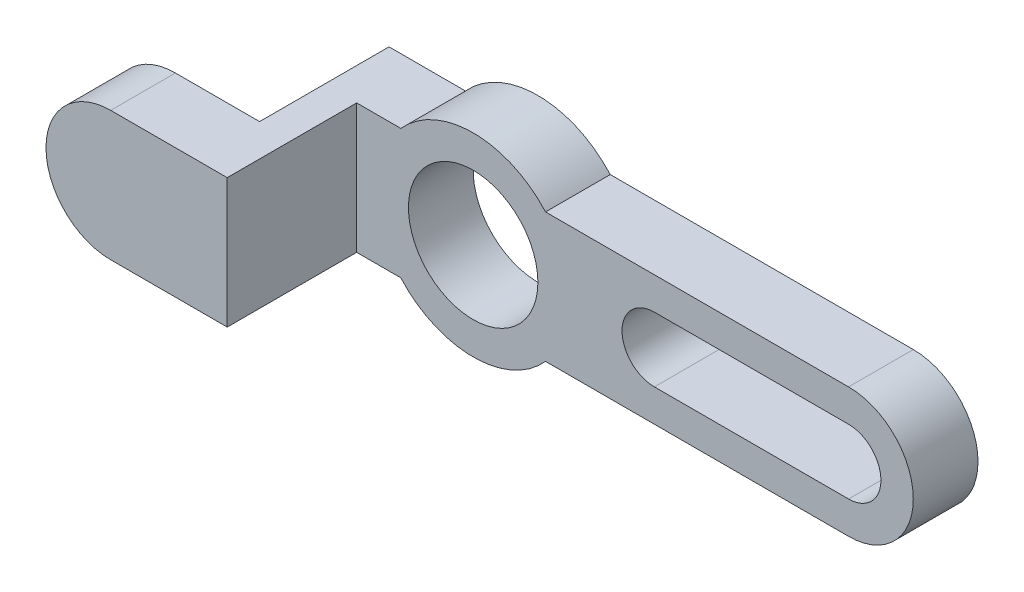
ISO-10303-21;
HEADER;
FILE_DESCRIPTION(('STEP AP214'),'2;1');
FILE_NAME('part.step','',(''),(''),'','','');
FILE_SCHEMA(('AUTOMOTIVE_DESIGN { 1 0 10303 214 1 1 1 1 }'));
ENDSEC;
DATA;
#1=APPLICATION_CONTEXT('core data for automotive mechanical design processes');
#2=APPLICATION_PROTOCOL_DEFINITION('international standard','automotive_design',2000,#1);
#3=PRODUCT_CONTEXT('',#1,'mechanical');
#4=PRODUCT('Part','Part','',(#3));
#5=PRODUCT_RELATED_PRODUCT_CATEGORY('part','',(#4));
#6=PRODUCT_DEFINITION_FORMATION('','',#4);
#7=PRODUCT_DEFINITION_CONTEXT('part definition',#1,'design');
#8=PRODUCT_DEFINITION('design','',#6,#7);
#9=PRODUCT_DEFINITION_SHAPE('','',#8);
#10=(LENGTH_UNIT() NAMED_UNIT(*) SI_UNIT(.MILLI.,.METRE.));
#11=(NAMED_UNIT(*) PLANE_ANGLE_UNIT() SI_UNIT($,.RADIAN.));
#12=(NAMED_UNIT(*) SI_UNIT($,.STERADIAN.) SOLID_ANGLE_UNIT());
#13=UNCERTAINTY_MEASURE_WITH_UNIT(LENGTH_MEASURE(1.E-05),#10,'distance_accuracy_value','');
#14=(GEOMETRIC_REPRESENTATION_CONTEXT(3) GLOBAL_UNCERTAINTY_ASSIGNED_CONTEXT((#13)) GLOBAL_UNIT_ASSIGNED_CONTEXT((#10,
#11,#12)) REPRESENTATION_CONTEXT('',''));
#15=CARTESIAN_POINT('',(0.,0.,0.));
#16=DIRECTION('',(0.,0.,1.));
#17=DIRECTION('',(1.,0.,0.));
#18=AXIS2_PLACEMENT_3D('',#15,#16,#17);
#19=CARTESIAN_POINT('',(0.,0.,-3.175));
#20=DIRECTION('',(0.,0.,1.));
#21=DIRECTION('',(1.,0.,0.));
#22=AXIS2_PLACEMENT_3D('',#19,#20,#21);
#23=PLANE('',#22);
#24=CARTESIAN_POINT('',(17.78,0.,-3.175));
#25=DIRECTION('',(0.,0.,1.));
#26=DIRECTION('',(1.,0.,0.));
#27=AXIS2_PLACEMENT_3D('',#24,#25,#26);
#28=CIRCLE('',#27,3.17500000000001);
#29=CARTESIAN_POINT('',(17.78,-3.17500000000001,-3.175));
#30=VERTEX_POINT('',#29);
#31=CARTESIAN_POINT('',(17.78,3.17500000000001,-3.175));
#32=VERTEX_POINT('',#31);
#33=EDGE_CURVE('E247',#30,#32,#28,.F.);
#34=ORIENTED_EDGE('',*,*,#33,.F.);
#35=DIRECTION('',(-1.,0.,0.));
#36=VECTOR('',#35,1.);
#37=CARTESIAN_POINT('',(36.83,-3.17500000000001,-3.175));
#38=LINE('',#37,#36);
#39=CARTESIAN_POINT('',(36.83,-3.17500000000001,-3.175));
#40=VERTEX_POINT('',#39);
#41=EDGE_CURVE('E239',#40,#30,#38,.T.);
#42=ORIENTED_EDGE('',*,*,#41,.F.);
#43=CARTESIAN_POINT('',(36.83,0.,-3.175));
#44=DIRECTION('',(0.,0.,-1.));
#45=DIRECTION('',(-1.,0.,0.));
#46=AXIS2_PLACEMENT_3D('',#43,#44,#45);
#47=CIRCLE('',#46,3.17500000000001);
#48=CARTESIAN_POINT('',(36.83,3.17500000000001,-3.175));
#49=VERTEX_POINT('',#48);
#50=EDGE_CURVE('E235',#49,#40,#47,.T.);
#51=ORIENTED_EDGE('',*,*,#50,.F.);
#52=DIRECTION('',(1.,0.,0.));
#53=VECTOR('',#52,1.);
#54=CARTESIAN_POINT('',(36.83,3.17500000000001,-3.175));
#55=LINE('',#54,#53);
#56=EDGE_CURVE('E249',#32,#49,#55,.T.);
#57=ORIENTED_EDGE('',*,*,#56,.F.);
#58=EDGE_LOOP('',(#34,#42,#51,#57));
#59=FACE_BOUND('',#58,.T.);
#60=CARTESIAN_POINT('',(0.,0.,-3.175));
#61=DIRECTION('',(0.,0.,1.));
#62=DIRECTION('',(1.,0.,0.));
#63=AXIS2_PLACEMENT_3D('',#60,#61,#62);
#64=CIRCLE('',#63,6.35);
#65=CARTESIAN_POINT('',(6.35,0.,-3.175));
#66=VERTEX_POINT('',#65);
#67=EDGE_CURVE('E285',#66,#66,#64,.T.);
#68=ORIENTED_EDGE('',*,*,#67,.T.);
#69=EDGE_LOOP('',(#68));
#70=FACE_BOUND('',#69,.T.);
#71=DIRECTION('',(0.,1.,0.));
#72=VECTOR('',#71,1.);
#73=CARTESIAN_POINT('',(-14.605,6.35,-3.175));
#74=LINE('',#73,#72);
#75=CARTESIAN_POINT('',(-14.605,-6.35,-3.175));
#76=VERTEX_POINT('',#75);
#77=CARTESIAN_POINT('',(-14.605,6.35,-3.175));
#78=VERTEX_POINT('',#77);
#79=EDGE_CURVE('E160',#76,#78,#74,.T.);
#80=ORIENTED_EDGE('',*,*,#79,.T.);
#81=DIRECTION('',(-1.,0.,0.));
#82=VECTOR('',#81,1.);
#83=CARTESIAN_POINT('',(-17.78,6.35,-3.175));
#84=LINE('',#83,#82);
#85=CARTESIAN_POINT('',(-7.09951582856183,6.35,-3.175));
#86=VERTEX_POINT('',#85);
#87=EDGE_CURVE('E188',#86,#78,#84,.T.);
#88=ORIENTED_EDGE('',*,*,#87,.F.);
#89=CARTESIAN_POINT('',(0.,0.,-3.175));
#90=DIRECTION('',(0.,0.,1.));
#91=DIRECTION('',(1.,0.,0.));
#92=AXIS2_PLACEMENT_3D('',#89,#90,#91);
#93=CIRCLE('',#92,9.525);
#94=CARTESIAN_POINT('',(7.09951582856183,6.35,-3.175));
#95=VERTEX_POINT('',#94);
#96=EDGE_CURVE('E87',#95,#86,#93,.T.);
#97=ORIENTED_EDGE('',*,*,#96,.F.);
#98=DIRECTION('',(-1.,0.,0.));
#99=VECTOR('',#98,1.);
#100=CARTESIAN_POINT('',(7.09951582856183,6.35,-3.175));
#101=LINE('',#100,#99);
#102=CARTESIAN_POINT('',(36.83,6.35,-3.175));
#103=VERTEX_POINT('',#102);
#104=EDGE_CURVE('E201',#103,#95,#101,.T.);
#105=ORIENTED_EDGE('',*,*,#104,.F.);
#106=CARTESIAN_POINT('',(36.83,0.,-3.175));
#107=DIRECTION('',(0.,0.,-1.));
#108=DIRECTION('',(-1.,0.,0.));
#109=AXIS2_PLACEMENT_3D('',#106,#107,#108);
#110=CIRCLE('',#109,6.35);
#111=CARTESIAN_POINT('',(36.83,-6.35,-3.175));
#112=VERTEX_POINT('',#111);
#113=EDGE_CURVE('E275',#103,#112,#110,.T.);
#114=ORIENTED_EDGE('',*,*,#113,.T.);
#115=DIRECTION('',(1.,0.,0.));
#116=VECTOR('',#115,1.);
#117=CARTESIAN_POINT('',(36.83,-6.35,-3.175));
#118=LINE('',#117,#116);
#119=CARTESIAN_POINT('',(7.09951582856183,-6.35,-3.175));
#120=VERTEX_POINT('',#119);
#121=EDGE_CURVE('E192',#120,#112,#118,.T.);
#122=ORIENTED_EDGE('',*,*,#121,.F.);
#123=CARTESIAN_POINT('',(0.,0.,-3.175));
#124=DIRECTION('',(0.,0.,1.));
#125=DIRECTION('',(1.,0.,0.));
#126=AXIS2_PLACEMENT_3D('',#123,#124,#125);
#127=CIRCLE('',#126,9.525);
#128=CARTESIAN_POINT('',(-7.09951582856183,-6.35,-3.175));
#129=VERTEX_POINT('',#128);
#130=EDGE_CURVE('E186',#129,#120,#127,.T.);
#131=ORIENTED_EDGE('',*,*,#130,.F.);
#132=DIRECTION('',(1.,0.,0.));
#133=VECTOR('',#132,1.);
#134=CARTESIAN_POINT('',(-17.78,-6.35,-3.175));
#135=LINE('',#134,#133);
#136=EDGE_CURVE('E176',#76,#129,#135,.T.);
#137=ORIENTED_EDGE('',*,*,#136,.F.);
#138=EDGE_LOOP('',(#80,#88,#97,#105,#114,#122,#131,#137));
#139=FACE_BOUND('',#138,.T.);
#140=ADVANCED_FACE('F40',(#59,#70,#139),#23,.F.);
#141=CARTESIAN_POINT('',(0.,0.,3.175));
#142=DIRECTION('',(0.,0.,1.));
#143=DIRECTION('',(1.,0.,0.));
#144=AXIS2_PLACEMENT_3D('',#141,#142,#143);
#145=PLANE('',#144);
#146=DIRECTION('',(0.,1.,0.));
#147=VECTOR('',#146,1.);
#148=CARTESIAN_POINT('',(-11.43,6.35,3.175));
#149=LINE('',#148,#147);
#150=CARTESIAN_POINT('',(-11.43,-6.35,3.175));
#151=VERTEX_POINT('',#150);
#152=CARTESIAN_POINT('',(-11.43,6.35,3.175));
#153=VERTEX_POINT('',#152);
#154=EDGE_CURVE('E56',#151,#153,#149,.T.);
#155=ORIENTED_EDGE('',*,*,#154,.F.);
#156=DIRECTION('',(1.,0.,0.));
#157=VECTOR('',#156,1.);
#158=CARTESIAN_POINT('',(-17.78,-6.35,3.175));
#159=LINE('',#158,#157);
#160=CARTESIAN_POINT('',(-7.09951582856183,-6.35,3.175));
#161=VERTEX_POINT('',#160);
#162=EDGE_CURVE('E91',#151,#161,#159,.T.);
#163=ORIENTED_EDGE('',*,*,#162,.T.);
#164=CARTESIAN_POINT('',(0.,0.,3.175));
#165=DIRECTION('',(0.,0.,1.));
#166=DIRECTION('',(1.,0.,0.));
#167=AXIS2_PLACEMENT_3D('',#164,#165,#166);
#168=CIRCLE('',#167,9.525);
#169=CARTESIAN_POINT('',(7.09951582856183,-6.35,3.175));
#170=VERTEX_POINT('',#169);
#171=EDGE_CURVE('E296',#161,#170,#168,.T.);
#172=ORIENTED_EDGE('',*,*,#171,.T.);
#173=DIRECTION('',(1.,0.,0.));
#174=VECTOR('',#173,1.);
#175=CARTESIAN_POINT('',(7.09951582856183,-6.35,3.175));
#176=LINE('',#175,#174);
#177=CARTESIAN_POINT('',(36.83,-6.35,3.175));
#178=VERTEX_POINT('',#177);
#179=EDGE_CURVE('E299',#170,#178,#176,.T.);
#180=ORIENTED_EDGE('',*,*,#179,.T.);
#181=CARTESIAN_POINT('',(36.83,0.,3.175));
#182=DIRECTION('',(0.,0.,1.));
#183=DIRECTION('',(1.,0.,0.));
#184=AXIS2_PLACEMENT_3D('',#181,#182,#183);
#185=CIRCLE('',#184,6.35);
#186=CARTESIAN_POINT('',(36.83,6.35,3.175));
#187=VERTEX_POINT('',#186);
#188=EDGE_CURVE('E253',#187,#178,#185,.F.);
#189=ORIENTED_EDGE('',*,*,#188,.F.);
#190=DIRECTION('',(-1.,0.,0.));
#191=VECTOR('',#190,1.);
#192=CARTESIAN_POINT('',(31.75,6.35,3.175));
#193=LINE('',#192,#191);
#194=CARTESIAN_POINT('',(7.09951582856183,6.35,3.175));
#195=VERTEX_POINT('',#194);
#196=EDGE_CURVE('E303',#187,#195,#193,.T.);
#197=ORIENTED_EDGE('',*,*,#196,.T.);
#198=CARTESIAN_POINT('',(0.,0.,3.175));
#199=DIRECTION('',(0.,0.,1.));
#200=DIRECTION('',(1.,0.,0.));
#201=AXIS2_PLACEMENT_3D('',#198,#199,#200);
#202=CIRCLE('',#201,9.525);
#203=CARTESIAN_POINT('',(-7.09951582856183,6.35,3.175));
#204=VERTEX_POINT('',#203);
#205=EDGE_CURVE('E63',#195,#204,#202,.T.);
#206=ORIENTED_EDGE('',*,*,#205,.T.);
#207=DIRECTION('',(-1.,0.,0.));
#208=VECTOR('',#207,1.);
#209=CARTESIAN_POINT('',(-17.78,6.35,3.175));
#210=LINE('',#209,#208);
#211=EDGE_CURVE('E206',#204,#153,#210,.T.);
#212=ORIENTED_EDGE('',*,*,#211,.T.);
#213=EDGE_LOOP('',(#155,#163,#172,#180,#189,#197,#206,#212));
#214=FACE_BOUND('',#213,.T.);
#215=DIRECTION('',(1.,0.,0.));
#216=VECTOR('',#215,1.);
#217=CARTESIAN_POINT('',(36.83,-3.17500000000001,3.175));
#218=LINE('',#217,#216);
#219=CARTESIAN_POINT('',(17.78,-3.17500000000001,3.175));
#220=VERTEX_POINT('',#219);
#221=CARTESIAN_POINT('',(36.83,-3.17500000000001,3.175));
#222=VERTEX_POINT('',#221);
#223=EDGE_CURVE('E242',#220,#222,#218,.T.);
#224=ORIENTED_EDGE('',*,*,#223,.F.);
#225=CARTESIAN_POINT('',(17.78,0.,3.175));
#226=DIRECTION('',(0.,0.,1.));
#227=DIRECTION('',(1.,0.,0.));
#228=AXIS2_PLACEMENT_3D('',#225,#226,#227);
#229=CIRCLE('',#228,3.17500000000001);
#230=CARTESIAN_POINT('',(17.78,3.17500000000001,3.175));
#231=VERTEX_POINT('',#230);
#232=EDGE_CURVE('E263',#231,#220,#229,.T.);
#233=ORIENTED_EDGE('',*,*,#232,.F.);
#234=DIRECTION('',(-1.,0.,0.));
#235=VECTOR('',#234,1.);
#236=CARTESIAN_POINT('',(36.83,3.17500000000001,3.175));
#237=LINE('',#236,#235);
#238=CARTESIAN_POINT('',(36.83,3.17500000000001,3.175));
#239=VERTEX_POINT('',#238);
#240=EDGE_CURVE('E259',#239,#231,#237,.T.);
#241=ORIENTED_EDGE('',*,*,#240,.F.);
#242=CARTESIAN_POINT('',(36.83,0.,3.175));
#243=DIRECTION('',(0.,0.,1.));
#244=DIRECTION('',(1.,0.,0.));
#245=AXIS2_PLACEMENT_3D('',#242,#243,#244);
#246=CIRCLE('',#245,3.17500000000001);
#247=EDGE_CURVE('E233',#239,#222,#246,.F.);
#248=ORIENTED_EDGE('',*,*,#247,.T.);
#249=EDGE_LOOP('',(#224,#233,#241,#248));
#250=FACE_BOUND('',#249,.T.);
#251=CARTESIAN_POINT('',(0.,0.,3.175));
#252=DIRECTION('',(0.,0.,1.));
#253=DIRECTION('',(1.,0.,0.));
#254=AXIS2_PLACEMENT_3D('',#251,#252,#253);
#255=CIRCLE('',#254,6.35);
#256=CARTESIAN_POINT('',(6.35,0.,3.175));
#257=VERTEX_POINT('',#256);
#258=EDGE_CURVE('E194',#257,#257,#255,.T.);
#259=ORIENTED_EDGE('',*,*,#258,.F.);
#260=EDGE_LOOP('',(#259));
#261=FACE_BOUND('',#260,.T.);
#262=ADVANCED_FACE('F309',(#214,#250,#261),#145,.T.);
#263=CARTESIAN_POINT('',(-17.78,6.35,3.175));
#264=DIRECTION('',(0.,-1.,0.));
#265=DIRECTION('',(0.,0.,-1.));
#266=AXIS2_PLACEMENT_3D('',#263,#264,#265);
#267=PLANE('',#266);
#268=DIRECTION('',(0.,0.,1.));
#269=VECTOR('',#268,1.);
#270=CARTESIAN_POINT('',(-14.605,6.35,9.525));
#271=LINE('',#270,#269);
#272=CARTESIAN_POINT('',(-14.605,6.35,9.525));
#273=VERTEX_POINT('',#272);
#274=EDGE_CURVE('E166',#78,#273,#271,.T.);
#275=ORIENTED_EDGE('',*,*,#274,.T.);
#276=DIRECTION('',(1.,0.,0.));
#277=VECTOR('',#276,1.);
#278=CARTESIAN_POINT('',(-22.86,6.35,9.525));
#279=LINE('',#278,#277);
#280=CARTESIAN_POINT('',(-22.86,6.35,9.525));
#281=VERTEX_POINT('',#280);
#282=EDGE_CURVE('E328',#281,#273,#279,.T.);
#283=ORIENTED_EDGE('',*,*,#282,.F.);
#284=DIRECTION('',(0.,0.,-1.));
#285=VECTOR('',#284,1.);
#286=CARTESIAN_POINT('',(-22.86,6.35,15.875));
#287=LINE('',#286,#285);
#288=CARTESIAN_POINT('',(-22.86,6.35,15.875));
#289=VERTEX_POINT('',#288);
#290=EDGE_CURVE('E351',#289,#281,#287,.T.);
#291=ORIENTED_EDGE('',*,*,#290,.F.);
#292=DIRECTION('',(-1.,0.,0.));
#293=VECTOR('',#292,1.);
#294=CARTESIAN_POINT('',(-17.78,6.35,15.875));
#295=LINE('',#294,#293);
#296=CARTESIAN_POINT('',(-11.43,6.35,15.875));
#297=VERTEX_POINT('',#296);
#298=EDGE_CURVE('E337',#297,#289,#295,.T.);
#299=ORIENTED_EDGE('',*,*,#298,.F.);
#300=DIRECTION('',(0.,0.,-1.));
#301=VECTOR('',#300,1.);
#302=CARTESIAN_POINT('',(-11.43,6.35,15.875));
#303=LINE('',#302,#301);
#304=EDGE_CURVE('E320',#297,#153,#303,.T.);
#305=ORIENTED_EDGE('',*,*,#304,.T.);
#306=ORIENTED_EDGE('',*,*,#211,.F.);
#307=DIRECTION('',(0.,0.,-1.));
#308=VECTOR('',#307,1.);
#309=CARTESIAN_POINT('',(-7.09951582856183,6.35,3.175));
#310=LINE('',#309,#308);
#311=EDGE_CURVE('E207',#204,#86,#310,.T.);
#312=ORIENTED_EDGE('',*,*,#311,.T.);
#313=ORIENTED_EDGE('',*,*,#87,.T.);
#314=EDGE_LOOP('',(#275,#283,#291,#299,#305,#306,#312,#313));
#315=FACE_BOUND('',#314,.T.);
#316=ADVANCED_FACE('F42',(#315),#267,.F.);
#317=CARTESIAN_POINT('',(-17.78,-6.35,3.175));
#318=DIRECTION('',(0.,1.,0.));
#319=DIRECTION('',(0.,0.,1.));
#320=AXIS2_PLACEMENT_3D('',#317,#318,#319);
#321=PLANE('',#320);
#322=DIRECTION('',(1.,0.,0.));
#323=VECTOR('',#322,1.);
#324=CARTESIAN_POINT('',(-22.86,-6.35,9.525));
#325=LINE('',#324,#323);
#326=CARTESIAN_POINT('',(-22.86,-6.35,9.525));
#327=VERTEX_POINT('',#326);
#328=CARTESIAN_POINT('',(-14.605,-6.35,9.525));
#329=VERTEX_POINT('',#328);
#330=EDGE_CURVE('E179',#327,#329,#325,.T.);
#331=ORIENTED_EDGE('',*,*,#330,.T.);
#332=DIRECTION('',(0.,0.,-1.));
#333=VECTOR('',#332,1.);
#334=CARTESIAN_POINT('',(-14.605,-6.35,-3.175));
#335=LINE('',#334,#333);
#336=EDGE_CURVE('E164',#329,#76,#335,.T.);
#337=ORIENTED_EDGE('',*,*,#336,.T.);
#338=ORIENTED_EDGE('',*,*,#136,.T.);
#339=DIRECTION('',(0.,0.,-1.));
#340=VECTOR('',#339,1.);
#341=CARTESIAN_POINT('',(-7.09951582856183,-6.35,3.175));
#342=LINE('',#341,#340);
#343=EDGE_CURVE('E224',#161,#129,#342,.T.);
#344=ORIENTED_EDGE('',*,*,#343,.F.);
#345=ORIENTED_EDGE('',*,*,#162,.F.);
#346=DIRECTION('',(0.,0.,-1.));
#347=VECTOR('',#346,1.);
#348=CARTESIAN_POINT('',(-11.43,-6.35,15.875));
#349=LINE('',#348,#347);
#350=CARTESIAN_POINT('',(-11.43,-6.35,15.875));
#351=VERTEX_POINT('',#350);
#352=EDGE_CURVE('E264',#351,#151,#349,.T.);
#353=ORIENTED_EDGE('',*,*,#352,.F.);
#354=DIRECTION('',(1.,0.,0.));
#355=VECTOR('',#354,1.);
#356=CARTESIAN_POINT('',(-17.78,-6.35,15.875));
#357=LINE('',#356,#355);
#358=CARTESIAN_POINT('',(-22.86,-6.35,15.875));
#359=VERTEX_POINT('',#358);
#360=EDGE_CURVE('E327',#359,#351,#357,.T.);
#361=ORIENTED_EDGE('',*,*,#360,.F.);
#362=DIRECTION('',(0.,0.,1.));
#363=VECTOR('',#362,1.);
#364=CARTESIAN_POINT('',(-22.86,-6.35,15.875));
#365=LINE('',#364,#363);
#366=EDGE_CURVE('E347',#327,#359,#365,.T.);
#367=ORIENTED_EDGE('',*,*,#366,.F.);
#368=EDGE_LOOP('',(#331,#337,#338,#344,#345,#353,#361,#367));
#369=FACE_BOUND('',#368,.T.);
#370=ADVANCED_FACE('F175',(#369),#321,.F.);
#371=CARTESIAN_POINT('',(0.,0.,3.175));
#372=DIRECTION('',(0.,0.,-1.));
#373=DIRECTION('',(-1.,0.,0.));
#374=AXIS2_PLACEMENT_3D('',#371,#372,#373);
#375=CYLINDRICAL_SURFACE('',#374,9.525);
#376=ORIENTED_EDGE('',*,*,#130,.T.);
#377=DIRECTION('',(0.,0.,-1.));
#378=VECTOR('',#377,1.);
#379=CARTESIAN_POINT('',(7.09951582856183,-6.35,3.175));
#380=LINE('',#379,#378);
#381=EDGE_CURVE('E220',#170,#120,#380,.T.);
#382=ORIENTED_EDGE('',*,*,#381,.F.);
#383=ORIENTED_EDGE('',*,*,#171,.F.);
#384=ORIENTED_EDGE('',*,*,#343,.T.);
#385=EDGE_LOOP('',(#376,#382,#383,#384));
#386=FACE_BOUND('',#385,.T.);
#387=ADVANCED_FACE('F377',(#386),#375,.T.);
#388=CARTESIAN_POINT('',(36.83,-6.35,3.175));
#389=DIRECTION('',(0.,1.,0.));
#390=DIRECTION('',(0.,0.,1.));
#391=AXIS2_PLACEMENT_3D('',#388,#389,#390);
#392=PLANE('',#391);
#393=ORIENTED_EDGE('',*,*,#121,.T.);
#394=DIRECTION('',(0.,0.,-1.));
#395=VECTOR('',#394,1.);
#396=CARTESIAN_POINT('',(36.83,-6.35,3.175));
#397=LINE('',#396,#395);
#398=EDGE_CURVE('E217',#178,#112,#397,.T.);
#399=ORIENTED_EDGE('',*,*,#398,.F.);
#400=ORIENTED_EDGE('',*,*,#179,.F.);
#401=ORIENTED_EDGE('',*,*,#381,.T.);
#402=EDGE_LOOP('',(#393,#399,#400,#401));
#403=FACE_BOUND('',#402,.T.);
#404=ADVANCED_FACE('F374',(#403),#392,.F.);
#405=CARTESIAN_POINT('',(7.09951582856183,6.35,3.175));
#406=DIRECTION('',(0.,-1.,0.));
#407=DIRECTION('',(0.,0.,-1.));
#408=AXIS2_PLACEMENT_3D('',#405,#406,#407);
#409=PLANE('',#408);
#410=ORIENTED_EDGE('',*,*,#104,.T.);
#411=DIRECTION('',(0.,0.,-1.));
#412=VECTOR('',#411,1.);
#413=CARTESIAN_POINT('',(7.09951582856183,6.35,3.175));
#414=LINE('',#413,#412);
#415=EDGE_CURVE('E210',#195,#95,#414,.T.);
#416=ORIENTED_EDGE('',*,*,#415,.F.);
#417=ORIENTED_EDGE('',*,*,#196,.F.);
#418=DIRECTION('',(0.,0.,-1.));
#419=VECTOR('',#418,1.);
#420=CARTESIAN_POINT('',(36.83,6.35,3.175));
#421=LINE('',#420,#419);
#422=EDGE_CURVE('E213',#187,#103,#421,.T.);
#423=ORIENTED_EDGE('',*,*,#422,.T.);
#424=EDGE_LOOP('',(#410,#416,#417,#423));
#425=FACE_BOUND('',#424,.T.);
#426=ADVANCED_FACE('F312',(#425),#409,.F.);
#427=CARTESIAN_POINT('',(0.,0.,3.175));
#428=DIRECTION('',(0.,0.,-1.));
#429=DIRECTION('',(-1.,0.,0.));
#430=AXIS2_PLACEMENT_3D('',#427,#428,#429);
#431=CYLINDRICAL_SURFACE('',#430,9.525);
#432=ORIENTED_EDGE('',*,*,#96,.T.);
#433=ORIENTED_EDGE('',*,*,#311,.F.);
#434=ORIENTED_EDGE('',*,*,#205,.F.);
#435=ORIENTED_EDGE('',*,*,#415,.T.);
#436=EDGE_LOOP('',(#432,#433,#434,#435));
#437=FACE_BOUND('',#436,.T.);
#438=ADVANCED_FACE('F314',(#437),#431,.T.);
#439=CARTESIAN_POINT('',(0.,0.,3.175));
#440=DIRECTION('',(0.,0.,-1.));
#441=DIRECTION('',(-1.,0.,0.));
#442=AXIS2_PLACEMENT_3D('',#439,#440,#441);
#443=CYLINDRICAL_SURFACE('',#442,6.35);
#444=ORIENTED_EDGE('',*,*,#258,.T.);
#445=EDGE_LOOP('',(#444));
#446=FACE_BOUND('',#445,.T.);
#447=ORIENTED_EDGE('',*,*,#67,.F.);
#448=EDGE_LOOP('',(#447));
#449=FACE_BOUND('',#448,.T.);
#450=ADVANCED_FACE('F402',(#446,#449),#443,.F.);
#451=CARTESIAN_POINT('',(36.83,0.,21.1355122421383));
#452=DIRECTION('',(0.,0.,-1.));
#453=DIRECTION('',(-1.,0.,0.));
#454=AXIS2_PLACEMENT_3D('',#451,#452,#453);
#455=CYLINDRICAL_SURFACE('',#454,3.17500000000001);
#456=ORIENTED_EDGE('',*,*,#247,.F.);
#457=DIRECTION('',(0.,0.,-1.));
#458=VECTOR('',#457,1.);
#459=CARTESIAN_POINT('',(36.83,3.17500000000001,21.1355122421383));
#460=LINE('',#459,#458);
#461=EDGE_CURVE('E12',#239,#49,#460,.T.);
#462=ORIENTED_EDGE('',*,*,#461,.T.);
#463=ORIENTED_EDGE('',*,*,#50,.T.);
#464=DIRECTION('',(0.,0.,-1.));
#465=VECTOR('',#464,1.);
#466=CARTESIAN_POINT('',(36.83,-3.17500000000001,21.1355122421383));
#467=LINE('',#466,#465);
#468=EDGE_CURVE('E49',#40,#222,#467,.F.);
#469=ORIENTED_EDGE('',*,*,#468,.T.);
#470=EDGE_LOOP('',(#456,#462,#463,#469));
#471=FACE_BOUND('',#470,.T.);
#472=ADVANCED_FACE('F231',(#471),#455,.F.);
#473=CARTESIAN_POINT('',(36.83,0.,21.1355122421383));
#474=DIRECTION('',(0.,0.,-1.));
#475=DIRECTION('',(-1.,0.,0.));
#476=AXIS2_PLACEMENT_3D('',#473,#474,#475);
#477=CYLINDRICAL_SURFACE('',#476,6.35);
#478=ORIENTED_EDGE('',*,*,#398,.T.);
#479=ORIENTED_EDGE('',*,*,#113,.F.);
#480=ORIENTED_EDGE('',*,*,#422,.F.);
#481=ORIENTED_EDGE('',*,*,#188,.T.);
#482=EDGE_LOOP('',(#478,#479,#480,#481));
#483=FACE_BOUND('',#482,.T.);
#484=ADVANCED_FACE('F370',(#483),#477,.T.);
#485=CARTESIAN_POINT('',(36.83,-3.17500000000001,-29.3567207226722));
#486=DIRECTION('',(0.,-1.,0.));
#487=DIRECTION('',(1.,0.,0.));
#488=AXIS2_PLACEMENT_3D('',#485,#486,#487);
#489=PLANE('',#488);
#490=ORIENTED_EDGE('',*,*,#41,.T.);
#491=DIRECTION('',(0.,0.,1.));
#492=VECTOR('',#491,1.);
#493=CARTESIAN_POINT('',(17.78,-3.17500000000001,-29.3567207226722));
#494=LINE('',#493,#492);
#495=EDGE_CURVE('E255',#30,#220,#494,.T.);
#496=ORIENTED_EDGE('',*,*,#495,.T.);
#497=ORIENTED_EDGE('',*,*,#223,.T.);
#498=ORIENTED_EDGE('',*,*,#468,.F.);
#499=EDGE_LOOP('',(#490,#496,#497,#498));
#500=FACE_BOUND('',#499,.T.);
#501=ADVANCED_FACE('F238',(#500),#489,.F.);
#502=CARTESIAN_POINT('',(17.78,0.,-29.3567207226722));
#503=DIRECTION('',(0.,0.,1.));
#504=DIRECTION('',(1.,0.,0.));
#505=AXIS2_PLACEMENT_3D('',#502,#503,#504);
#506=CYLINDRICAL_SURFACE('',#505,3.17500000000001);
#507=ORIENTED_EDGE('',*,*,#33,.T.);
#508=DIRECTION('',(0.,0.,1.));
#509=VECTOR('',#508,1.);
#510=CARTESIAN_POINT('',(17.78,3.17500000000001,-29.3567207226722));
#511=LINE('',#510,#509);
#512=EDGE_CURVE('E270',#32,#231,#511,.T.);
#513=ORIENTED_EDGE('',*,*,#512,.T.);
#514=ORIENTED_EDGE('',*,*,#232,.T.);
#515=ORIENTED_EDGE('',*,*,#495,.F.);
#516=EDGE_LOOP('',(#507,#513,#514,#515));
#517=FACE_BOUND('',#516,.T.);
#518=ADVANCED_FACE('F500',(#517),#506,.F.);
#519=CARTESIAN_POINT('',(36.83,3.17500000000001,-29.3567207226722));
#520=DIRECTION('',(0.,1.,0.));
#521=DIRECTION('',(-1.,0.,0.));
#522=AXIS2_PLACEMENT_3D('',#519,#520,#521);
#523=PLANE('',#522);
#524=ORIENTED_EDGE('',*,*,#56,.T.);
#525=ORIENTED_EDGE('',*,*,#461,.F.);
#526=ORIENTED_EDGE('',*,*,#240,.T.);
#527=ORIENTED_EDGE('',*,*,#512,.F.);
#528=EDGE_LOOP('',(#524,#525,#526,#527));
#529=FACE_BOUND('',#528,.T.);
#530=ADVANCED_FACE('F390',(#529),#523,.F.);
#531=CARTESIAN_POINT('',(-11.43,6.35,15.875));
#532=DIRECTION('',(-1.,0.,0.));
#533=DIRECTION('',(0.,0.,1.));
#534=AXIS2_PLACEMENT_3D('',#531,#532,#533);
#535=PLANE('',#534);
#536=ORIENTED_EDGE('',*,*,#154,.T.);
#537=ORIENTED_EDGE('',*,*,#304,.F.);
#538=DIRECTION('',(0.,1.,0.));
#539=VECTOR('',#538,1.);
#540=CARTESIAN_POINT('',(-11.43,6.35,15.875));
#541=LINE('',#540,#539);
#542=EDGE_CURVE('E332',#351,#297,#541,.T.);
#543=ORIENTED_EDGE('',*,*,#542,.F.);
#544=ORIENTED_EDGE('',*,*,#352,.T.);
#545=EDGE_LOOP('',(#536,#537,#543,#544));
#546=FACE_BOUND('',#545,.T.);
#547=ADVANCED_FACE('F323',(#546),#535,.F.);
#548=CARTESIAN_POINT('',(0.,0.,15.875));
#549=DIRECTION('',(0.,0.,1.));
#550=DIRECTION('',(1.,0.,0.));
#551=AXIS2_PLACEMENT_3D('',#548,#549,#550);
#552=PLANE('',#551);
#553=ORIENTED_EDGE('',*,*,#298,.T.);
#554=CARTESIAN_POINT('',(-22.86,0.,15.875));
#555=DIRECTION('',(0.,0.,1.));
#556=DIRECTION('',(1.,0.,0.));
#557=AXIS2_PLACEMENT_3D('',#554,#555,#556);
#558=CIRCLE('',#557,6.35);
#559=EDGE_CURVE('E172',#289,#359,#558,.T.);
#560=ORIENTED_EDGE('',*,*,#559,.T.);
#561=ORIENTED_EDGE('',*,*,#360,.T.);
#562=ORIENTED_EDGE('',*,*,#542,.T.);
#563=EDGE_LOOP('',(#553,#560,#561,#562));
#564=FACE_BOUND('',#563,.T.);
#565=ADVANCED_FACE('F382',(#564),#552,.T.);
#566=CARTESIAN_POINT('',(-22.86,6.35,9.525));
#567=DIRECTION('',(0.,0.,1.));
#568=DIRECTION('',(1.,0.,0.));
#569=AXIS2_PLACEMENT_3D('',#566,#567,#568);
#570=PLANE('',#569);
#571=ORIENTED_EDGE('',*,*,#330,.F.);
#572=CARTESIAN_POINT('',(-22.86,0.,9.525));
#573=DIRECTION('',(0.,0.,1.));
#574=DIRECTION('',(1.,0.,0.));
#575=AXIS2_PLACEMENT_3D('',#572,#573,#574);
#576=CIRCLE('',#575,6.35);
#577=EDGE_CURVE('E355',#327,#281,#576,.F.);
#578=ORIENTED_EDGE('',*,*,#577,.T.);
#579=ORIENTED_EDGE('',*,*,#282,.T.);
#580=DIRECTION('',(0.,-1.,0.));
#581=VECTOR('',#580,1.);
#582=CARTESIAN_POINT('',(-14.605,-6.35,9.525));
#583=LINE('',#582,#581);
#584=EDGE_CURVE('E182',#273,#329,#583,.T.);
#585=ORIENTED_EDGE('',*,*,#584,.T.);
#586=EDGE_LOOP('',(#571,#578,#579,#585));
#587=FACE_BOUND('',#586,.T.);
#588=ADVANCED_FACE('F366',(#587),#570,.F.);
#589=CARTESIAN_POINT('',(-22.86,0.,-8.43551224213832));
#590=DIRECTION('',(0.,0.,1.));
#591=DIRECTION('',(1.,0.,0.));
#592=AXIS2_PLACEMENT_3D('',#589,#590,#591);
#593=CYLINDRICAL_SURFACE('',#592,6.35);
#594=ORIENTED_EDGE('',*,*,#290,.T.);
#595=ORIENTED_EDGE('',*,*,#577,.F.);
#596=ORIENTED_EDGE('',*,*,#366,.T.);
#597=ORIENTED_EDGE('',*,*,#559,.F.);
#598=EDGE_LOOP('',(#594,#595,#596,#597));
#599=FACE_BOUND('',#598,.T.);
#600=ADVANCED_FACE('F381',(#599),#593,.T.);
#601=CARTESIAN_POINT('',(-14.605,6.35,15.875));
#602=DIRECTION('',(-1.,0.,0.));
#603=DIRECTION('',(0.,0.,1.));
#604=AXIS2_PLACEMENT_3D('',#601,#602,#603);
#605=PLANE('',#604);
#606=ORIENTED_EDGE('',*,*,#274,.F.);
#607=ORIENTED_EDGE('',*,*,#79,.F.);
#608=ORIENTED_EDGE('',*,*,#336,.F.);
#609=ORIENTED_EDGE('',*,*,#584,.F.);
#610=EDGE_LOOP('',(#606,#607,#608,#609));
#611=FACE_BOUND('',#610,.T.);
#612=ADVANCED_FACE('F162',(#611),#605,.T.);
#613=CLOSED_SHELL('',(#140,#262,#316,#370,#387,#404,#426,#438,#450,#472,#484,#501,#518,#530,
#547,#565,#588,#600,#612));
#614=MANIFOLD_SOLID_BREP('B2',#613);
#615=ADVANCED_BREP_SHAPE_REPRESENTATION('',(#18,#614),#14);
#616=SHAPE_DEFINITION_REPRESENTATION(#9,#615);
ENDSEC;
END-ISO-10303-21;
